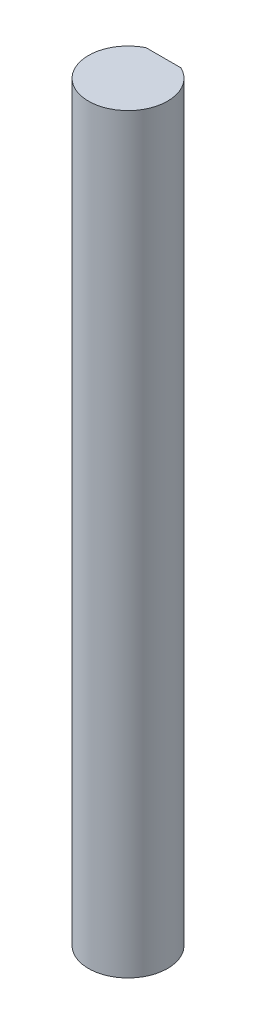
ISO-10303-21;
HEADER;
FILE_DESCRIPTION(('STEP AP214'),'2;1');
FILE_NAME('part.step','',(''),(''),'','','');
FILE_SCHEMA(('AUTOMOTIVE_DESIGN { 1 0 10303 214 1 1 1 1 }'));
ENDSEC;
DATA;
#1=APPLICATION_CONTEXT('core data for automotive mechanical design processes');
#2=APPLICATION_PROTOCOL_DEFINITION('international standard','automotive_design',2000,#1);
#3=PRODUCT_CONTEXT('',#1,'mechanical');
#4=PRODUCT('Part','Part','',(#3));
#5=PRODUCT_RELATED_PRODUCT_CATEGORY('part','',(#4));
#6=PRODUCT_DEFINITION_FORMATION('','',#4);
#7=PRODUCT_DEFINITION_CONTEXT('part definition',#1,'design');
#8=PRODUCT_DEFINITION('design','',#6,#7);
#9=PRODUCT_DEFINITION_SHAPE('','',#8);
#10=(LENGTH_UNIT() NAMED_UNIT(*) SI_UNIT(.MILLI.,.METRE.));
#11=(NAMED_UNIT(*) PLANE_ANGLE_UNIT() SI_UNIT($,.RADIAN.));
#12=(NAMED_UNIT(*) SI_UNIT($,.STERADIAN.) SOLID_ANGLE_UNIT());
#13=UNCERTAINTY_MEASURE_WITH_UNIT(LENGTH_MEASURE(1.E-05),#10,'distance_accuracy_value','');
#14=(GEOMETRIC_REPRESENTATION_CONTEXT(3) GLOBAL_UNCERTAINTY_ASSIGNED_CONTEXT((#13)) GLOBAL_UNIT_ASSIGNED_CONTEXT((#10,
#11,#12)) REPRESENTATION_CONTEXT('',''));
#15=CARTESIAN_POINT('',(0.,0.,0.));
#16=DIRECTION('',(0.,0.,1.));
#17=DIRECTION('',(1.,0.,0.));
#18=AXIS2_PLACEMENT_3D('',#15,#16,#17);
#19=CARTESIAN_POINT('',(0.,45.,0.));
#20=DIRECTION('',(0.,-1.,0.));
#21=DIRECTION('',(0.,0.,-1.));
#22=AXIS2_PLACEMENT_3D('',#19,#20,#21);
#23=CYLINDRICAL_SURFACE('',#22,2.37166904267614);
#24=CARTESIAN_POINT('',(0.,0.,0.));
#25=DIRECTION('',(0.,1.,0.));
#26=DIRECTION('',(0.,0.,1.));
#27=AXIS2_PLACEMENT_3D('',#24,#25,#26);
#28=CIRCLE('',#27,2.37166904267614);
#29=CARTESIAN_POINT('',(-1.04643269448409,0.,-2.12833095732386));
#30=VERTEX_POINT('',#29);
#31=CARTESIAN_POINT('',(1.04643269448409,0.,-2.12833095732386));
#32=VERTEX_POINT('',#31);
#33=EDGE_CURVE('E78',#30,#32,#28,.T.);
#34=ORIENTED_EDGE('',*,*,#33,.T.);
#35=DIRECTION('',(0.,-1.,0.));
#36=VECTOR('',#35,1.);
#37=CARTESIAN_POINT('',(1.04643269448409,45.,-2.12833095732386));
#38=LINE('',#37,#36);
#39=CARTESIAN_POINT('',(1.04643269448409,45.,-2.12833095732386));
#40=VERTEX_POINT('',#39);
#41=EDGE_CURVE('E11',#40,#32,#38,.T.);
#42=ORIENTED_EDGE('',*,*,#41,.F.);
#43=CARTESIAN_POINT('',(0.,45.,0.));
#44=DIRECTION('',(0.,1.,0.));
#45=DIRECTION('',(0.,0.,1.));
#46=AXIS2_PLACEMENT_3D('',#43,#44,#45);
#47=CIRCLE('',#46,2.37166904267614);
#48=CARTESIAN_POINT('',(-1.04643269448409,45.,-2.12833095732386));
#49=VERTEX_POINT('',#48);
#50=EDGE_CURVE('E77',#49,#40,#47,.T.);
#51=ORIENTED_EDGE('',*,*,#50,.F.);
#52=DIRECTION('',(0.,-1.,0.));
#53=VECTOR('',#52,1.);
#54=CARTESIAN_POINT('',(-1.04643269448409,45.,-2.12833095732386));
#55=LINE('',#54,#53);
#56=EDGE_CURVE('E54',#49,#30,#55,.T.);
#57=ORIENTED_EDGE('',*,*,#56,.T.);
#58=EDGE_LOOP('',(#34,#42,#51,#57));
#59=FACE_BOUND('',#58,.T.);
#60=ADVANCED_FACE('F45',(#59),#23,.T.);
#61=CARTESIAN_POINT('',(-1.04643269448409,45.,-2.12833095732386));
#62=DIRECTION('',(0.,0.,1.));
#63=DIRECTION('',(1.,0.,0.));
#64=AXIS2_PLACEMENT_3D('',#61,#62,#63);
#65=PLANE('',#64);
#66=DIRECTION('',(-1.,0.,0.));
#67=VECTOR('',#66,1.);
#68=CARTESIAN_POINT('',(-1.04643269448409,0.,-2.12833095732386));
#69=LINE('',#68,#67);
#70=EDGE_CURVE('E69',#32,#30,#69,.T.);
#71=ORIENTED_EDGE('',*,*,#70,.T.);
#72=ORIENTED_EDGE('',*,*,#56,.F.);
#73=DIRECTION('',(-1.,0.,0.));
#74=VECTOR('',#73,1.);
#75=CARTESIAN_POINT('',(-1.04643269448409,45.,-2.12833095732386));
#76=LINE('',#75,#74);
#77=EDGE_CURVE('E61',#40,#49,#76,.T.);
#78=ORIENTED_EDGE('',*,*,#77,.F.);
#79=ORIENTED_EDGE('',*,*,#41,.T.);
#80=EDGE_LOOP('',(#71,#72,#78,#79));
#81=FACE_BOUND('',#80,.T.);
#82=ADVANCED_FACE('F72',(#81),#65,.F.);
#83=CARTESIAN_POINT('',(0.,45.,0.));
#84=DIRECTION('',(0.,1.,0.));
#85=DIRECTION('',(0.,0.,1.));
#86=AXIS2_PLACEMENT_3D('',#83,#84,#85);
#87=PLANE('',#86);
#88=ORIENTED_EDGE('',*,*,#50,.T.);
#89=ORIENTED_EDGE('',*,*,#77,.T.);
#90=EDGE_LOOP('',(#88,#89));
#91=FACE_BOUND('',#90,.T.);
#92=ADVANCED_FACE('F89',(#91),#87,.T.);
#93=CARTESIAN_POINT('',(0.,0.,0.));
#94=DIRECTION('',(0.,1.,0.));
#95=DIRECTION('',(0.,0.,1.));
#96=AXIS2_PLACEMENT_3D('',#93,#94,#95);
#97=PLANE('',#96);
#98=ORIENTED_EDGE('',*,*,#33,.F.);
#99=ORIENTED_EDGE('',*,*,#70,.F.);
#100=EDGE_LOOP('',(#98,#99));
#101=FACE_BOUND('',#100,.T.);
#102=ADVANCED_FACE('F82',(#101),#97,.F.);
#103=CLOSED_SHELL('',(#60,#82,#92,#102));
#104=MANIFOLD_SOLID_BREP('B2',#103);
#105=ADVANCED_BREP_SHAPE_REPRESENTATION('',(#18,#104),#14);
#106=SHAPE_DEFINITION_REPRESENTATION(#9,#105);
ENDSEC;
END-ISO-10303-21;
